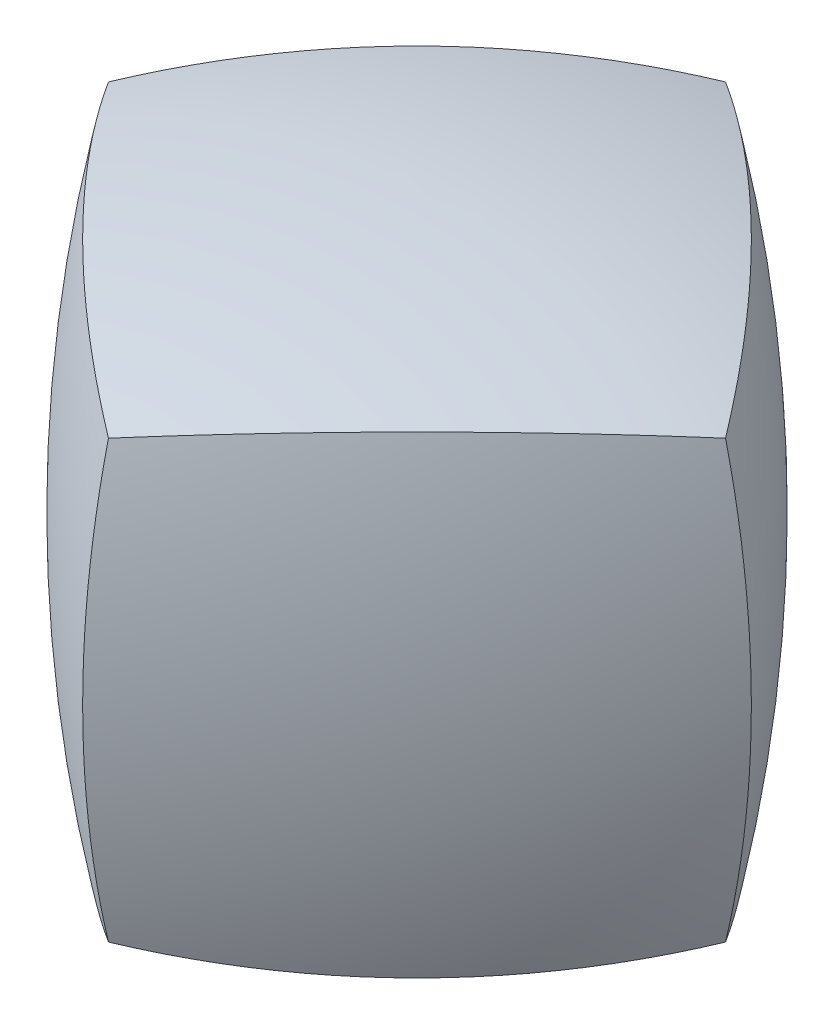
ISO-10303-21;
HEADER;
FILE_DESCRIPTION(('STEP AP214'),'2;1');
FILE_NAME('part.step','',(''),(''),'','','');
FILE_SCHEMA(('AUTOMOTIVE_DESIGN { 1 0 10303 214 1 1 1 1 }'));
ENDSEC;
DATA;
#1=APPLICATION_CONTEXT('core data for automotive mechanical design processes');
#2=APPLICATION_PROTOCOL_DEFINITION('international standard','automotive_design',2000,#1);
#3=PRODUCT_CONTEXT('',#1,'mechanical');
#4=PRODUCT('Part','Part','',(#3));
#5=PRODUCT_RELATED_PRODUCT_CATEGORY('part','',(#4));
#6=PRODUCT_DEFINITION_FORMATION('','',#4);
#7=PRODUCT_DEFINITION_CONTEXT('part definition',#1,'design');
#8=PRODUCT_DEFINITION('design','',#6,#7);
#9=PRODUCT_DEFINITION_SHAPE('','',#8);
#10=(LENGTH_UNIT() NAMED_UNIT(*) SI_UNIT(.MILLI.,.METRE.));
#11=(NAMED_UNIT(*) PLANE_ANGLE_UNIT() SI_UNIT($,.RADIAN.));
#12=(NAMED_UNIT(*) SI_UNIT($,.STERADIAN.) SOLID_ANGLE_UNIT());
#13=UNCERTAINTY_MEASURE_WITH_UNIT(LENGTH_MEASURE(1.E-05),#10,'distance_accuracy_value','');
#14=(GEOMETRIC_REPRESENTATION_CONTEXT(3) GLOBAL_UNCERTAINTY_ASSIGNED_CONTEXT((#13)) GLOBAL_UNIT_ASSIGNED_CONTEXT((#10,
#11,#12)) REPRESENTATION_CONTEXT('',''));
#15=CARTESIAN_POINT('',(0.,0.,0.));
#16=DIRECTION('',(0.,0.,1.));
#17=DIRECTION('',(1.,0.,0.));
#18=AXIS2_PLACEMENT_3D('',#15,#16,#17);
#19=CARTESIAN_POINT('',(0.,-49.53,0.));
#20=DIRECTION('',(0.,1.,0.));
#21=DIRECTION('',(1.,0.,0.));
#22=AXIS2_PLACEMENT_3D('',#19,#20,#21);
#23=SPHERICAL_SURFACE('',#22,64.77);
#24=CARTESIAN_POINT('',(-17.5114994360849,-24.7649999999999,-17.5114994360849));
#25=DIRECTION('',(0.499999999999999,-0.707106781186549,0.499999999999999));
#26=DIRECTION('',(0.816496580927727,0.577350269189624,0.));
#27=AXIS2_PLACEMENT_3D('',#24,#25,#26);
#28=CIRCLE('',#27,54.484332151546);
#29=CARTESIAN_POINT('',(17.9605122421383,12.7,0.));
#30=VERTEX_POINT('',#29);
#31=CARTESIAN_POINT('',(0.,12.7,17.9605122421383));
#32=VERTEX_POINT('',#31);
#33=EDGE_CURVE('E51',#30,#32,#28,.T.);
#34=ORIENTED_EDGE('',*,*,#33,.F.);
#35=CARTESIAN_POINT('',(-17.5114994360849,-24.7649999999999,17.5114994360849));
#36=DIRECTION('',(0.499999999999999,-0.707106781186549,-0.499999999999999));
#37=DIRECTION('',(0.,0.577350269189624,-0.816496580927727));
#38=AXIS2_PLACEMENT_3D('',#35,#36,#37);
#39=CIRCLE('',#38,54.484332151546);
#40=CARTESIAN_POINT('',(0.,12.7,-17.9605122421383));
#41=VERTEX_POINT('',#40);
#42=EDGE_CURVE('E109',#41,#30,#39,.T.);
#43=ORIENTED_EDGE('',*,*,#42,.F.);
#44=CARTESIAN_POINT('',(17.5114994360849,-24.7649999999999,17.5114994360849));
#45=DIRECTION('',(-0.499999999999999,-0.707106781186549,-0.499999999999999));
#46=DIRECTION('',(0.,0.577350269189624,-0.816496580927727));
#47=AXIS2_PLACEMENT_3D('',#44,#45,#46);
#48=CIRCLE('',#47,54.484332151546);
#49=CARTESIAN_POINT('',(-17.9605122421383,12.7,0.));
#50=VERTEX_POINT('',#49);
#51=EDGE_CURVE('E107',#50,#41,#48,.T.);
#52=ORIENTED_EDGE('',*,*,#51,.F.);
#53=CARTESIAN_POINT('',(17.5114994360849,-24.7649999999999,-17.5114994360849));
#54=DIRECTION('',(-0.499999999999999,-0.707106781186549,0.499999999999999));
#55=DIRECTION('',(0.,-0.577350269189624,-0.816496580927727));
#56=AXIS2_PLACEMENT_3D('',#53,#54,#55);
#57=CIRCLE('',#56,54.484332151546);
#58=EDGE_CURVE('E12',#32,#50,#57,.T.);
#59=ORIENTED_EDGE('',*,*,#58,.F.);
#60=EDGE_LOOP('',(#34,#43,#52,#59));
#61=FACE_BOUND('',#60,.T.);
#62=ADVANCED_FACE('F43',(#61),#23,.T.);
#63=CARTESIAN_POINT('',(-35.0229988721698,1.729330707129E-13,-35.0229988721696));
#64=DIRECTION('',(0.70710678118655,0.,0.707106781186545));
#65=DIRECTION('',(0.5,0.707106781186547,-0.5));
#66=AXIS2_PLACEMENT_3D('',#63,#64,#65);
#67=SPHERICAL_SURFACE('',#66,64.77);
#68=CARTESIAN_POINT('',(-35.0229988721696,0.,2.15957214695252E-13));
#69=DIRECTION('',(0.,0.,-1.));
#70=DIRECTION('',(0.816496580927727,0.577350269189624,0.));
#71=AXIS2_PLACEMENT_3D('',#68,#69,#70);
#72=CIRCLE('',#71,54.484332151546);
#73=CARTESIAN_POINT('',(17.9605122421383,-12.7,0.));
#74=VERTEX_POINT('',#73);
#75=EDGE_CURVE('E103',#30,#74,#72,.T.);
#76=ORIENTED_EDGE('',*,*,#75,.F.);
#77=ORIENTED_EDGE('',*,*,#33,.T.);
#78=CARTESIAN_POINT('',(0.,0.,-35.0229988721696));
#79=DIRECTION('',(-1.,0.,0.));
#80=DIRECTION('',(0.,0.577350269189624,0.816496580927727));
#81=AXIS2_PLACEMENT_3D('',#78,#79,#80);
#82=CIRCLE('',#81,54.484332151546);
#83=CARTESIAN_POINT('',(0.,-12.7,17.9605122421383));
#84=VERTEX_POINT('',#83);
#85=EDGE_CURVE('E61',#84,#32,#82,.T.);
#86=ORIENTED_EDGE('',*,*,#85,.F.);
#87=CARTESIAN_POINT('',(-17.5114994360848,24.7650000000001,-17.5114994360846));
#88=DIRECTION('',(-0.500000000000004,-0.707106781186544,-0.500000000000001));
#89=DIRECTION('',(-0.816496580927724,0.577350269189628,0.));
#90=AXIS2_PLACEMENT_3D('',#87,#88,#89);
#91=CIRCLE('',#90,54.484332151546);
#92=EDGE_CURVE('E96',#74,#84,#91,.T.);
#93=ORIENTED_EDGE('',*,*,#92,.F.);
#94=EDGE_LOOP('',(#76,#77,#86,#93));
#95=FACE_BOUND('',#94,.T.);
#96=ADVANCED_FACE('F114',(#95),#67,.T.);
#97=CARTESIAN_POINT('',(-35.0229988721695,1.729330707129E-13,35.0229988721699));
#98=DIRECTION('',(0.707106781186543,0.,-0.707106781186552));
#99=DIRECTION('',(-0.500000000000002,0.707106781186547,-0.499999999999998));
#100=AXIS2_PLACEMENT_3D('',#97,#98,#99);
#101=SPHERICAL_SURFACE('',#100,64.77);
#102=CARTESIAN_POINT('',(3.38239361687756E-13,0.,35.0229988721696));
#103=DIRECTION('',(-1.,0.,0.));
#104=DIRECTION('',(0.,0.577350269189624,-0.816496580927727));
#105=AXIS2_PLACEMENT_3D('',#102,#103,#104);
#106=CIRCLE('',#105,54.484332151546);
#107=CARTESIAN_POINT('',(-1.58377332702538E-13,-12.7,-17.9605122421383));
#108=VERTEX_POINT('',#107);
#109=EDGE_CURVE('E90',#41,#108,#106,.T.);
#110=ORIENTED_EDGE('',*,*,#109,.F.);
#111=ORIENTED_EDGE('',*,*,#42,.T.);
#112=ORIENTED_EDGE('',*,*,#75,.T.);
#113=CARTESIAN_POINT('',(-17.5114994360846,24.7650000000001,17.5114994360848));
#114=DIRECTION('',(-0.499999999999999,-0.707106781186544,0.500000000000006));
#115=DIRECTION('',(0.,0.577350269189628,0.816496580927724));
#116=AXIS2_PLACEMENT_3D('',#113,#114,#115);
#117=CIRCLE('',#116,54.484332151546);
#118=EDGE_CURVE('E100',#108,#74,#117,.T.);
#119=ORIENTED_EDGE('',*,*,#118,.F.);
#120=EDGE_LOOP('',(#110,#111,#112,#119));
#121=FACE_BOUND('',#120,.T.);
#122=ADVANCED_FACE('F117',(#121),#101,.T.);
#123=CARTESIAN_POINT('',(35.0229988721701,1.729330707129E-13,35.0229988721693));
#124=DIRECTION('',(-0.707106781186555,0.,-0.70710678118654));
#125=DIRECTION('',(-0.499999999999997,0.707106781186547,0.500000000000004));
#126=AXIS2_PLACEMENT_3D('',#123,#124,#125);
#127=SPHERICAL_SURFACE('',#126,64.77);
#128=CARTESIAN_POINT('',(35.0229988721696,0.,-4.60521508680261E-13));
#129=DIRECTION('',(0.,0.,1.));
#130=DIRECTION('',(-0.816496580927727,0.577350269189624,0.));
#131=AXIS2_PLACEMENT_3D('',#128,#129,#130);
#132=CIRCLE('',#131,54.484332151546);
#133=CARTESIAN_POINT('',(-17.9605122421383,-12.7,2.21086126032028E-13));
#134=VERTEX_POINT('',#133);
#135=EDGE_CURVE('E78',#50,#134,#132,.T.);
#136=ORIENTED_EDGE('',*,*,#135,.F.);
#137=ORIENTED_EDGE('',*,*,#51,.T.);
#138=ORIENTED_EDGE('',*,*,#109,.T.);
#139=CARTESIAN_POINT('',(17.5114994360849,24.7650000000001,17.5114994360845));
#140=DIRECTION('',(0.500000000000008,-0.707106781186544,0.499999999999997));
#141=DIRECTION('',(0.816496580927724,0.577350269189628,0.));
#142=AXIS2_PLACEMENT_3D('',#139,#140,#141);
#143=CIRCLE('',#142,54.484332151546);
#144=EDGE_CURVE('E84',#134,#108,#143,.T.);
#145=ORIENTED_EDGE('',*,*,#144,.F.);
#146=EDGE_LOOP('',(#136,#137,#138,#145));
#147=FACE_BOUND('',#146,.T.);
#148=ADVANCED_FACE('F88',(#147),#127,.T.);
#149=CARTESIAN_POINT('',(-2.44702591523094E-13,49.53,2.44702591523094E-13));
#150=DIRECTION('',(0.,-1.,0.));
#151=DIRECTION('',(0.,0.,1.));
#152=AXIS2_PLACEMENT_3D('',#149,#150,#151);
#153=SPHERICAL_SURFACE('',#152,64.77);
#154=ORIENTED_EDGE('',*,*,#92,.T.);
#155=CARTESIAN_POINT('',(17.5114994360847,24.7650000000001,-17.5114994360847));
#156=DIRECTION('',(-0.500000000000003,0.707106781186544,0.500000000000003));
#157=DIRECTION('',(-0.816496580927724,-0.577350269189628,0.));
#158=AXIS2_PLACEMENT_3D('',#155,#156,#157);
#159=CIRCLE('',#158,54.484332151546);
#160=EDGE_CURVE('E81',#134,#84,#159,.T.);
#161=ORIENTED_EDGE('',*,*,#160,.F.);
#162=ORIENTED_EDGE('',*,*,#144,.T.);
#163=ORIENTED_EDGE('',*,*,#118,.T.);
#164=EDGE_LOOP('',(#154,#161,#162,#163));
#165=FACE_BOUND('',#164,.T.);
#166=ADVANCED_FACE('F95',(#165),#153,.T.);
#167=CARTESIAN_POINT('',(35.0229988721697,1.729330707129E-13,-35.0229988721697));
#168=DIRECTION('',(-0.707106781186548,0.,0.707106781186548));
#169=DIRECTION('',(0.499999999999998,0.707106781186547,0.500000000000002));
#170=AXIS2_PLACEMENT_3D('',#167,#168,#169);
#171=SPHERICAL_SURFACE('',#170,64.77);
#172=ORIENTED_EDGE('',*,*,#85,.T.);
#173=ORIENTED_EDGE('',*,*,#58,.T.);
#174=ORIENTED_EDGE('',*,*,#135,.T.);
#175=ORIENTED_EDGE('',*,*,#160,.T.);
#176=EDGE_LOOP('',(#172,#173,#174,#175));
#177=FACE_BOUND('',#176,.T.);
#178=ADVANCED_FACE('F45',(#177),#171,.T.);
#179=CLOSED_SHELL('',(#62,#96,#122,#148,#166,#178));
#180=MANIFOLD_SOLID_BREP('B2',#179);
#181=ADVANCED_BREP_SHAPE_REPRESENTATION('',(#18,#180),#14);
#182=SHAPE_DEFINITION_REPRESENTATION(#9,#181);
ENDSEC;
END-ISO-10303-21;
